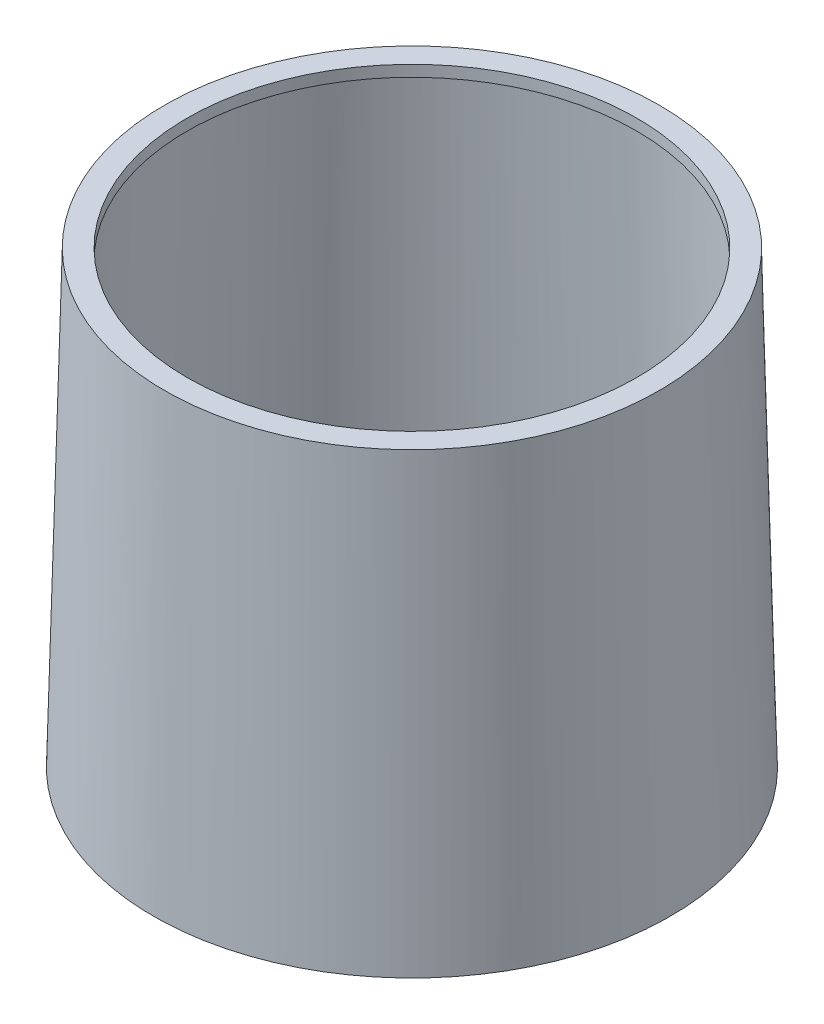
ISO-10303-21;
HEADER;
FILE_DESCRIPTION(('STEP AP214'),'2;1');
FILE_NAME('part.step','',(''),(''),'','','');
FILE_SCHEMA(('AUTOMOTIVE_DESIGN { 1 0 10303 214 1 1 1 1 }'));
ENDSEC;
DATA;
#1=APPLICATION_CONTEXT('core data for automotive mechanical design processes');
#2=APPLICATION_PROTOCOL_DEFINITION('international standard','automotive_design',2000,#1);
#3=PRODUCT_CONTEXT('',#1,'mechanical');
#4=PRODUCT('Part','Part','',(#3));
#5=PRODUCT_RELATED_PRODUCT_CATEGORY('part','',(#4));
#6=PRODUCT_DEFINITION_FORMATION('','',#4);
#7=PRODUCT_DEFINITION_CONTEXT('part definition',#1,'design');
#8=PRODUCT_DEFINITION('design','',#6,#7);
#9=PRODUCT_DEFINITION_SHAPE('','',#8);
#10=(LENGTH_UNIT() NAMED_UNIT(*) SI_UNIT(.MILLI.,.METRE.));
#11=(NAMED_UNIT(*) PLANE_ANGLE_UNIT() SI_UNIT($,.RADIAN.));
#12=(NAMED_UNIT(*) SI_UNIT($,.STERADIAN.) SOLID_ANGLE_UNIT());
#13=UNCERTAINTY_MEASURE_WITH_UNIT(LENGTH_MEASURE(1.E-05),#10,'distance_accuracy_value','');
#14=(GEOMETRIC_REPRESENTATION_CONTEXT(3) GLOBAL_UNCERTAINTY_ASSIGNED_CONTEXT((#13)) GLOBAL_UNIT_ASSIGNED_CONTEXT((#10,
#11,#12)) REPRESENTATION_CONTEXT('',''));
#15=CARTESIAN_POINT('',(0.,0.,0.));
#16=DIRECTION('',(0.,0.,1.));
#17=DIRECTION('',(1.,0.,0.));
#18=AXIS2_PLACEMENT_3D('',#15,#16,#17);
#19=CARTESIAN_POINT('',(0.,20.,0.));
#20=DIRECTION('',(0.,1.,0.));
#21=DIRECTION('',(0.,0.,1.));
#22=AXIS2_PLACEMENT_3D('',#19,#20,#21);
#23=PLANE('',#22);
#24=CARTESIAN_POINT('',(0.,20.,0.));
#25=DIRECTION('',(0.,1.,0.));
#26=DIRECTION('',(0.,0.,1.));
#27=AXIS2_PLACEMENT_3D('',#24,#25,#26);
#28=CIRCLE('',#27,10.);
#29=CARTESIAN_POINT('',(0.,20.,10.));
#30=VERTEX_POINT('',#29);
#31=EDGE_CURVE('E69',#30,#30,#28,.T.);
#32=ORIENTED_EDGE('',*,*,#31,.F.);
#33=EDGE_LOOP('',(#32));
#34=FACE_BOUND('',#33,.T.);
#35=CARTESIAN_POINT('',(0.,20.,0.));
#36=DIRECTION('',(0.,-1.,0.));
#37=DIRECTION('',(0.,0.,-1.));
#38=AXIS2_PLACEMENT_3D('',#35,#36,#37);
#39=CIRCLE('',#38,11.);
#40=CARTESIAN_POINT('',(0.,20.,-11.));
#41=VERTEX_POINT('',#40);
#42=EDGE_CURVE('E81',#41,#41,#39,.T.);
#43=ORIENTED_EDGE('',*,*,#42,.F.);
#44=EDGE_LOOP('',(#43));
#45=FACE_BOUND('',#44,.T.);
#46=ADVANCED_FACE('F49',(#34,#45),#23,.T.);
#47=CARTESIAN_POINT('',(0.,0.,0.));
#48=DIRECTION('',(0.,-1.,0.));
#49=DIRECTION('',(0.,0.,-1.));
#50=AXIS2_PLACEMENT_3D('',#47,#48,#49);
#51=CONICAL_SURFACE('',#50,11.5,0.0249947936189201);
#52=ORIENTED_EDGE('',*,*,#42,.T.);
#53=EDGE_LOOP('',(#52));
#54=FACE_BOUND('',#53,.T.);
#55=CARTESIAN_POINT('',(0.,0.,0.));
#56=DIRECTION('',(0.,-1.,0.));
#57=DIRECTION('',(0.,0.,-1.));
#58=AXIS2_PLACEMENT_3D('',#55,#56,#57);
#59=CIRCLE('',#58,11.5);
#60=CARTESIAN_POINT('',(0.,0.,-11.5));
#61=VERTEX_POINT('',#60);
#62=EDGE_CURVE('E70',#61,#61,#59,.T.);
#63=ORIENTED_EDGE('',*,*,#62,.F.);
#64=EDGE_LOOP('',(#63));
#65=FACE_BOUND('',#64,.T.);
#66=ADVANCED_FACE('F86',(#54,#65),#51,.T.);
#67=CARTESIAN_POINT('',(0.,0.,0.));
#68=DIRECTION('',(0.,-1.,0.));
#69=DIRECTION('',(0.,0.,-1.));
#70=AXIS2_PLACEMENT_3D('',#67,#68,#69);
#71=PLANE('',#70);
#72=CARTESIAN_POINT('',(0.,0.,0.));
#73=DIRECTION('',(0.,-1.,0.));
#74=DIRECTION('',(0.,0.,-1.));
#75=AXIS2_PLACEMENT_3D('',#72,#73,#74);
#76=CIRCLE('',#75,11.);
#77=CARTESIAN_POINT('',(0.,0.,-11.));
#78=VERTEX_POINT('',#77);
#79=EDGE_CURVE('E11',#78,#78,#76,.T.);
#80=ORIENTED_EDGE('',*,*,#79,.F.);
#81=EDGE_LOOP('',(#80));
#82=FACE_BOUND('',#81,.T.);
#83=ORIENTED_EDGE('',*,*,#62,.T.);
#84=EDGE_LOOP('',(#83));
#85=FACE_BOUND('',#84,.T.);
#86=ADVANCED_FACE('F95',(#82,#85),#71,.T.);
#87=CARTESIAN_POINT('',(0.,0.,0.));
#88=DIRECTION('',(0.,1.,0.));
#89=DIRECTION('',(0.,0.,1.));
#90=AXIS2_PLACEMENT_3D('',#87,#88,#89);
#91=CYLINDRICAL_SURFACE('',#90,10.);
#92=CARTESIAN_POINT('',(0.,19.5,0.));
#93=DIRECTION('',(0.,-1.,0.));
#94=DIRECTION('',(0.,0.,-1.));
#95=AXIS2_PLACEMENT_3D('',#92,#93,#94);
#96=CIRCLE('',#95,10.);
#97=CARTESIAN_POINT('',(0.,19.5,-10.));
#98=VERTEX_POINT('',#97);
#99=EDGE_CURVE('E66',#98,#98,#96,.T.);
#100=ORIENTED_EDGE('',*,*,#99,.T.);
#101=EDGE_LOOP('',(#100));
#102=FACE_BOUND('',#101,.T.);
#103=ORIENTED_EDGE('',*,*,#31,.T.);
#104=EDGE_LOOP('',(#103));
#105=FACE_BOUND('',#104,.T.);
#106=ADVANCED_FACE('F112',(#102,#105),#91,.F.);
#107=CARTESIAN_POINT('',(11.2500266837969,0.5,0.));
#108=DIRECTION('',(0.,-1.,0.));
#109=DIRECTION('',(0.,0.,-1.));
#110=AXIS2_PLACEMENT_3D('',#107,#108,#109);
#111=PLANE('',#110);
#112=CARTESIAN_POINT('',(0.,0.5,0.));
#113=DIRECTION('',(0.,-1.,0.));
#114=DIRECTION('',(0.,0.,-1.));
#115=AXIS2_PLACEMENT_3D('',#112,#113,#114);
#116=CIRCLE('',#115,11.);
#117=CARTESIAN_POINT('',(0.,0.5,-11.));
#118=VERTEX_POINT('',#117);
#119=EDGE_CURVE('E53',#118,#118,#116,.T.);
#120=ORIENTED_EDGE('',*,*,#119,.T.);
#121=EDGE_LOOP('',(#120));
#122=FACE_BOUND('',#121,.T.);
#123=CARTESIAN_POINT('',(0.,0.5,0.));
#124=DIRECTION('',(0.,-1.,0.));
#125=DIRECTION('',(0.,0.,-1.));
#126=AXIS2_PLACEMENT_3D('',#123,#124,#125);
#127=CIRCLE('',#126,11.2500266837969);
#128=CARTESIAN_POINT('',(0.,0.5,-11.2500266837969));
#129=VERTEX_POINT('',#128);
#130=EDGE_CURVE('E63',#129,#129,#127,.T.);
#131=ORIENTED_EDGE('',*,*,#130,.F.);
#132=EDGE_LOOP('',(#131));
#133=FACE_BOUND('',#132,.T.);
#134=ADVANCED_FACE('F51',(#122,#133),#111,.F.);
#135=CARTESIAN_POINT('',(0.,0.5,0.));
#136=DIRECTION('',(0.,-1.,0.));
#137=DIRECTION('',(0.,0.,-1.));
#138=AXIS2_PLACEMENT_3D('',#135,#136,#137);
#139=CONICAL_SURFACE('',#138,11.2500266837969,0.0337985845003617);
#140=CARTESIAN_POINT('',(0.,19.5,0.));
#141=DIRECTION('',(0.,-1.,0.));
#142=DIRECTION('',(0.,0.,-1.));
#143=AXIS2_PLACEMENT_3D('',#140,#141,#142);
#144=CIRCLE('',#143,10.6076089389059);
#145=CARTESIAN_POINT('',(0.,19.5,-10.6076089389059));
#146=VERTEX_POINT('',#145);
#147=EDGE_CURVE('E58',#146,#146,#144,.T.);
#148=ORIENTED_EDGE('',*,*,#147,.F.);
#149=EDGE_LOOP('',(#148));
#150=FACE_BOUND('',#149,.T.);
#151=ORIENTED_EDGE('',*,*,#130,.T.);
#152=EDGE_LOOP('',(#151));
#153=FACE_BOUND('',#152,.T.);
#154=ADVANCED_FACE('F99',(#150,#153),#139,.F.);
#155=CARTESIAN_POINT('',(10.6076089389059,19.5,0.));
#156=DIRECTION('',(0.,1.,0.));
#157=DIRECTION('',(0.,0.,1.));
#158=AXIS2_PLACEMENT_3D('',#155,#156,#157);
#159=PLANE('',#158);
#160=ORIENTED_EDGE('',*,*,#99,.F.);
#161=EDGE_LOOP('',(#160));
#162=FACE_BOUND('',#161,.T.);
#163=ORIENTED_EDGE('',*,*,#147,.T.);
#164=EDGE_LOOP('',(#163));
#165=FACE_BOUND('',#164,.T.);
#166=ADVANCED_FACE('F102',(#162,#165),#159,.F.);
#167=CARTESIAN_POINT('',(0.,0.5,0.));
#168=DIRECTION('',(0.,-1.,0.));
#169=DIRECTION('',(0.,0.,-1.));
#170=AXIS2_PLACEMENT_3D('',#167,#168,#169);
#171=CYLINDRICAL_SURFACE('',#170,11.);
#172=ORIENTED_EDGE('',*,*,#119,.F.);
#173=EDGE_LOOP('',(#172));
#174=FACE_BOUND('',#173,.T.);
#175=ORIENTED_EDGE('',*,*,#79,.T.);
#176=EDGE_LOOP('',(#175));
#177=FACE_BOUND('',#176,.T.);
#178=ADVANCED_FACE('F106',(#174,#177),#171,.F.);
#179=CLOSED_SHELL('',(#46,#66,#86,#106,#134,#154,#166,#178));
#180=MANIFOLD_SOLID_BREP('B2',#179);
#181=CARTESIAN_POINT('',(0.,0.,0.));
#182=DIRECTION('',(0.,-1.,0.));
#183=DIRECTION('',(0.,0.,-1.));
#184=AXIS2_PLACEMENT_3D('',#181,#182,#183);
#185=PLANE('',#184);
#186=CARTESIAN_POINT('',(0.,0.,0.));
#187=DIRECTION('',(0.,1.,0.));
#188=DIRECTION('',(0.,0.,1.));
#189=AXIS2_PLACEMENT_3D('',#186,#187,#188);
#190=CIRCLE('',#189,10.);
#191=CARTESIAN_POINT('',(0.,0.,10.));
#192=VERTEX_POINT('',#191);
#193=EDGE_CURVE('E48',#192,#192,#190,.T.);
#194=ORIENTED_EDGE('',*,*,#193,.T.);
#195=EDGE_LOOP('',(#194));
#196=FACE_BOUND('',#195,.T.);
#197=CARTESIAN_POINT('',(0.,0.,0.));
#198=DIRECTION('',(0.,-1.,0.));
#199=DIRECTION('',(0.,0.,-1.));
#200=AXIS2_PLACEMENT_3D('',#197,#198,#199);
#201=CIRCLE('',#200,10.5);
#202=CARTESIAN_POINT('',(0.,0.,-10.5));
#203=VERTEX_POINT('',#202);
#204=EDGE_CURVE('E209',#203,#203,#201,.T.);
#205=ORIENTED_EDGE('',*,*,#204,.T.);
#206=EDGE_LOOP('',(#205));
#207=FACE_BOUND('',#206,.T.);
#208=ADVANCED_FACE('F195',(#196,#207),#185,.T.);
#209=CARTESIAN_POINT('',(0.,0.,0.));
#210=DIRECTION('',(0.,1.,0.));
#211=DIRECTION('',(0.,0.,1.));
#212=AXIS2_PLACEMENT_3D('',#209,#210,#211);
#213=CYLINDRICAL_SURFACE('',#212,10.);
#214=CARTESIAN_POINT('',(0.,0.5,0.));
#215=DIRECTION('',(0.,-1.,0.));
#216=DIRECTION('',(0.,0.,-1.));
#217=AXIS2_PLACEMENT_3D('',#214,#215,#216);
#218=CIRCLE('',#217,10.);
#219=CARTESIAN_POINT('',(0.,0.5,-10.));
#220=VERTEX_POINT('',#219);
#221=EDGE_CURVE('E201',#220,#220,#218,.T.);
#222=ORIENTED_EDGE('',*,*,#221,.F.);
#223=EDGE_LOOP('',(#222));
#224=FACE_BOUND('',#223,.T.);
#225=ORIENTED_EDGE('',*,*,#193,.F.);
#226=EDGE_LOOP('',(#225));
#227=FACE_BOUND('',#226,.T.);
#228=ADVANCED_FACE('F224',(#224,#227),#213,.F.);
#229=CARTESIAN_POINT('',(11.2500266837969,0.5,0.));
#230=DIRECTION('',(0.,-1.,0.));
#231=DIRECTION('',(0.,0.,-1.));
#232=AXIS2_PLACEMENT_3D('',#229,#230,#231);
#233=PLANE('',#232);
#234=ORIENTED_EDGE('',*,*,#221,.T.);
#235=EDGE_LOOP('',(#234));
#236=FACE_BOUND('',#235,.T.);
#237=CARTESIAN_POINT('',(0.,0.5,0.));
#238=DIRECTION('',(0.,-1.,0.));
#239=DIRECTION('',(0.,0.,-1.));
#240=AXIS2_PLACEMENT_3D('',#237,#238,#239);
#241=CIRCLE('',#240,10.5);
#242=CARTESIAN_POINT('',(0.,0.5,-10.5));
#243=VERTEX_POINT('',#242);
#244=EDGE_CURVE('E205',#243,#243,#241,.T.);
#245=ORIENTED_EDGE('',*,*,#244,.F.);
#246=EDGE_LOOP('',(#245));
#247=FACE_BOUND('',#246,.T.);
#248=ADVANCED_FACE('F218',(#236,#247),#233,.F.);
#249=CARTESIAN_POINT('',(0.,0.5,0.));
#250=DIRECTION('',(0.,-1.,0.));
#251=DIRECTION('',(0.,0.,-1.));
#252=AXIS2_PLACEMENT_3D('',#249,#250,#251);
#253=CYLINDRICAL_SURFACE('',#252,10.5);
#254=ORIENTED_EDGE('',*,*,#244,.T.);
#255=EDGE_LOOP('',(#254));
#256=FACE_BOUND('',#255,.T.);
#257=ORIENTED_EDGE('',*,*,#204,.F.);
#258=EDGE_LOOP('',(#257));
#259=FACE_BOUND('',#258,.T.);
#260=ADVANCED_FACE('F216',(#256,#259),#253,.T.);
#261=CLOSED_SHELL('',(#208,#228,#248,#260));
#262=MANIFOLD_SOLID_BREP('B6',#261);
#263=ADVANCED_BREP_SHAPE_REPRESENTATION('',(#18,#180,#262),#14);
#264=SHAPE_DEFINITION_REPRESENTATION(#9,#263);
ENDSEC;
END-ISO-10303-21;
